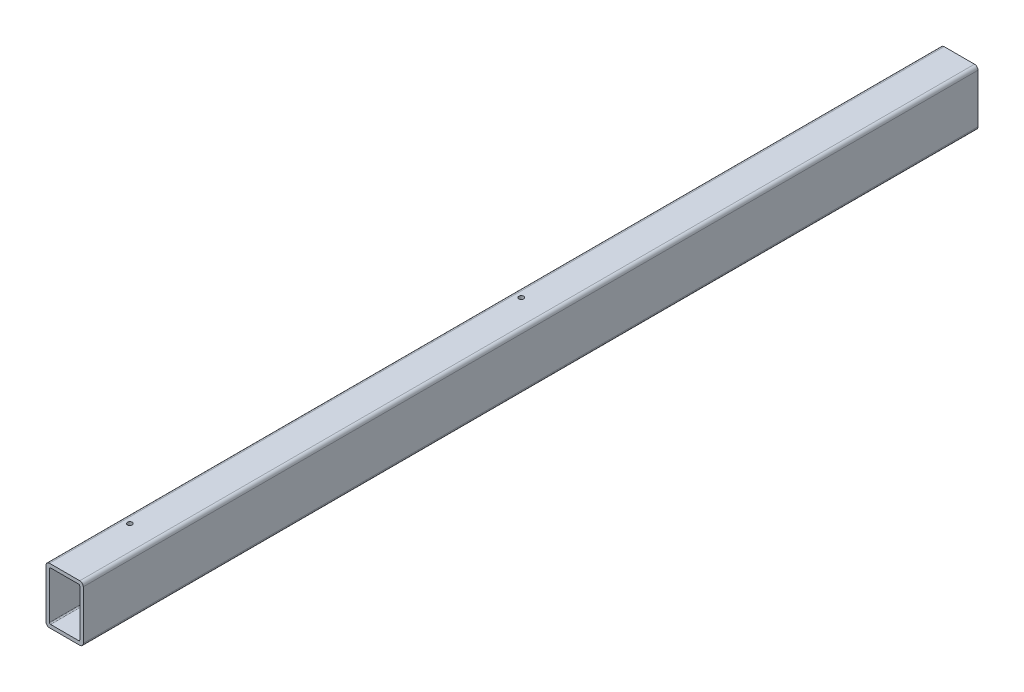
ISO-10303-21;
HEADER;
FILE_DESCRIPTION(('STEP AP214'),'2;1');
FILE_NAME('part.step','',(''),(''),'','','');
FILE_SCHEMA(('AUTOMOTIVE_DESIGN { 1 0 10303 214 1 1 1 1 }'));
ENDSEC;
DATA;
#1=APPLICATION_CONTEXT('core data for automotive mechanical design processes');
#2=APPLICATION_PROTOCOL_DEFINITION('international standard','automotive_design',2000,#1);
#3=PRODUCT_CONTEXT('',#1,'mechanical');
#4=PRODUCT('Part','Part','',(#3));
#5=PRODUCT_RELATED_PRODUCT_CATEGORY('part','',(#4));
#6=PRODUCT_DEFINITION_FORMATION('','',#4);
#7=PRODUCT_DEFINITION_CONTEXT('part definition',#1,'design');
#8=PRODUCT_DEFINITION('design','',#6,#7);
#9=PRODUCT_DEFINITION_SHAPE('','',#8);
#10=(LENGTH_UNIT() NAMED_UNIT(*) SI_UNIT(.MILLI.,.METRE.));
#11=(NAMED_UNIT(*) PLANE_ANGLE_UNIT() SI_UNIT($,.RADIAN.));
#12=(NAMED_UNIT(*) SI_UNIT($,.STERADIAN.) SOLID_ANGLE_UNIT());
#13=UNCERTAINTY_MEASURE_WITH_UNIT(LENGTH_MEASURE(1.E-05),#10,'distance_accuracy_value','');
#14=(GEOMETRIC_REPRESENTATION_CONTEXT(3) GLOBAL_UNCERTAINTY_ASSIGNED_CONTEXT((#13)) GLOBAL_UNIT_ASSIGNED_CONTEXT((#10,
#11,#12)) REPRESENTATION_CONTEXT('',''));
#15=CARTESIAN_POINT('',(0.,0.,0.));
#16=DIRECTION('',(0.,0.,1.));
#17=DIRECTION('',(1.,0.,0.));
#18=AXIS2_PLACEMENT_3D('',#15,#16,#17);
#19=CARTESIAN_POINT('',(-20.6375,-33.3375,609.6));
#20=DIRECTION('',(0.,0.,1.));
#21=DIRECTION('',(1.,0.,0.));
#22=AXIS2_PLACEMENT_3D('',#19,#20,#21);
#23=PLANE('',#22);
#24=CARTESIAN_POINT('',(-20.6375,-33.3375,609.6));
#25=DIRECTION('',(0.,0.,1.));
#26=DIRECTION('',(1.,0.,0.));
#27=AXIS2_PLACEMENT_3D('',#24,#25,#26);
#28=CIRCLE('',#27,4.7625);
#29=CARTESIAN_POINT('',(-25.4,-33.3375,609.6));
#30=VERTEX_POINT('',#29);
#31=CARTESIAN_POINT('',(-20.6375,-38.1,609.6));
#32=VERTEX_POINT('',#31);
#33=EDGE_CURVE('E212',#30,#32,#28,.T.);
#34=ORIENTED_EDGE('',*,*,#33,.T.);
#35=DIRECTION('',(1.,0.,0.));
#36=VECTOR('',#35,1.);
#37=CARTESIAN_POINT('',(-20.6375,-38.1,609.6));
#38=LINE('',#37,#36);
#39=CARTESIAN_POINT('',(20.6375,-38.1,609.6));
#40=VERTEX_POINT('',#39);
#41=EDGE_CURVE('E215',#32,#40,#38,.T.);
#42=ORIENTED_EDGE('',*,*,#41,.T.);
#43=CARTESIAN_POINT('',(20.6375,-33.3375,609.6));
#44=DIRECTION('',(0.,0.,1.));
#45=DIRECTION('',(1.,0.,0.));
#46=AXIS2_PLACEMENT_3D('',#43,#44,#45);
#47=CIRCLE('',#46,4.7625);
#48=CARTESIAN_POINT('',(25.4,-33.3375,609.6));
#49=VERTEX_POINT('',#48);
#50=EDGE_CURVE('E218',#40,#49,#47,.T.);
#51=ORIENTED_EDGE('',*,*,#50,.T.);
#52=DIRECTION('',(0.,1.,0.));
#53=VECTOR('',#52,1.);
#54=CARTESIAN_POINT('',(25.4,33.3375,609.6));
#55=LINE('',#54,#53);
#56=CARTESIAN_POINT('',(25.4,33.3375,609.6));
#57=VERTEX_POINT('',#56);
#58=EDGE_CURVE('E220',#49,#57,#55,.T.);
#59=ORIENTED_EDGE('',*,*,#58,.T.);
#60=CARTESIAN_POINT('',(20.6375,33.3375,609.6));
#61=DIRECTION('',(0.,0.,1.));
#62=DIRECTION('',(1.,0.,0.));
#63=AXIS2_PLACEMENT_3D('',#60,#61,#62);
#64=CIRCLE('',#63,4.7625);
#65=CARTESIAN_POINT('',(20.6375,38.1,609.6));
#66=VERTEX_POINT('',#65);
#67=EDGE_CURVE('E222',#57,#66,#64,.T.);
#68=ORIENTED_EDGE('',*,*,#67,.T.);
#69=DIRECTION('',(-1.,0.,0.));
#70=VECTOR('',#69,1.);
#71=CARTESIAN_POINT('',(-20.6375,38.1,609.6));
#72=LINE('',#71,#70);
#73=CARTESIAN_POINT('',(-20.6375,38.1,609.6));
#74=VERTEX_POINT('',#73);
#75=EDGE_CURVE('E224',#66,#74,#72,.T.);
#76=ORIENTED_EDGE('',*,*,#75,.T.);
#77=CARTESIAN_POINT('',(-20.6375,33.3375,609.6));
#78=DIRECTION('',(0.,0.,1.));
#79=DIRECTION('',(1.,0.,0.));
#80=AXIS2_PLACEMENT_3D('',#77,#78,#79);
#81=CIRCLE('',#80,4.7625);
#82=CARTESIAN_POINT('',(-25.4,33.3375,609.6));
#83=VERTEX_POINT('',#82);
#84=EDGE_CURVE('E226',#74,#83,#81,.T.);
#85=ORIENTED_EDGE('',*,*,#84,.T.);
#86=DIRECTION('',(0.,-1.,0.));
#87=VECTOR('',#86,1.);
#88=CARTESIAN_POINT('',(-25.4,33.3375,609.6));
#89=LINE('',#88,#87);
#90=EDGE_CURVE('E228',#83,#30,#89,.T.);
#91=ORIENTED_EDGE('',*,*,#90,.T.);
#92=EDGE_LOOP('',(#34,#42,#51,#59,#68,#76,#85,#91));
#93=FACE_BOUND('',#92,.T.);
#94=DIRECTION('',(1.,0.,0.));
#95=VECTOR('',#94,1.);
#96=CARTESIAN_POINT('',(-19.05,-33.3375,609.6));
#97=LINE('',#96,#95);
#98=CARTESIAN_POINT('',(-19.05,-33.3375,609.6));
#99=VERTEX_POINT('',#98);
#100=CARTESIAN_POINT('',(19.05,-33.3375,609.6));
#101=VERTEX_POINT('',#100);
#102=EDGE_CURVE('E153',#99,#101,#97,.T.);
#103=ORIENTED_EDGE('',*,*,#102,.F.);
#104=CARTESIAN_POINT('',(-19.05,-31.75,609.6));
#105=DIRECTION('',(0.,0.,1.));
#106=DIRECTION('',(1.,0.,0.));
#107=AXIS2_PLACEMENT_3D('',#104,#105,#106);
#108=CIRCLE('',#107,1.5875);
#109=CARTESIAN_POINT('',(-20.6375,-31.75,609.6));
#110=VERTEX_POINT('',#109);
#111=EDGE_CURVE('E145',#110,#99,#108,.T.);
#112=ORIENTED_EDGE('',*,*,#111,.F.);
#113=DIRECTION('',(0.,-1.,0.));
#114=VECTOR('',#113,1.);
#115=CARTESIAN_POINT('',(-20.6375,31.75,609.6));
#116=LINE('',#115,#114);
#117=CARTESIAN_POINT('',(-20.6375,31.75,609.6));
#118=VERTEX_POINT('',#117);
#119=EDGE_CURVE('E179',#118,#110,#116,.T.);
#120=ORIENTED_EDGE('',*,*,#119,.F.);
#121=CARTESIAN_POINT('',(-19.05,31.75,609.6));
#122=DIRECTION('',(0.,0.,1.));
#123=DIRECTION('',(1.,0.,0.));
#124=AXIS2_PLACEMENT_3D('',#121,#122,#123);
#125=CIRCLE('',#124,1.5875);
#126=CARTESIAN_POINT('',(-19.05,33.3375,609.6));
#127=VERTEX_POINT('',#126);
#128=EDGE_CURVE('E177',#127,#118,#125,.T.);
#129=ORIENTED_EDGE('',*,*,#128,.F.);
#130=DIRECTION('',(-1.,0.,0.));
#131=VECTOR('',#130,1.);
#132=CARTESIAN_POINT('',(-19.05,33.3375,609.6));
#133=LINE('',#132,#131);
#134=CARTESIAN_POINT('',(19.05,33.3375,609.6));
#135=VERTEX_POINT('',#134);
#136=EDGE_CURVE('E175',#135,#127,#133,.T.);
#137=ORIENTED_EDGE('',*,*,#136,.F.);
#138=CARTESIAN_POINT('',(19.05,31.75,609.6));
#139=DIRECTION('',(0.,0.,1.));
#140=DIRECTION('',(1.,0.,0.));
#141=AXIS2_PLACEMENT_3D('',#138,#139,#140);
#142=CIRCLE('',#141,1.5875);
#143=CARTESIAN_POINT('',(20.6375,31.75,609.6));
#144=VERTEX_POINT('',#143);
#145=EDGE_CURVE('E173',#144,#135,#142,.T.);
#146=ORIENTED_EDGE('',*,*,#145,.F.);
#147=DIRECTION('',(0.,1.,0.));
#148=VECTOR('',#147,1.);
#149=CARTESIAN_POINT('',(20.6375,31.75,609.6));
#150=LINE('',#149,#148);
#151=CARTESIAN_POINT('',(20.6375,-31.75,609.6));
#152=VERTEX_POINT('',#151);
#153=EDGE_CURVE('E168',#152,#144,#150,.T.);
#154=ORIENTED_EDGE('',*,*,#153,.F.);
#155=CARTESIAN_POINT('',(19.05,-31.75,609.6));
#156=DIRECTION('',(0.,0.,1.));
#157=DIRECTION('',(1.,0.,0.));
#158=AXIS2_PLACEMENT_3D('',#155,#156,#157);
#159=CIRCLE('',#158,1.5875);
#160=EDGE_CURVE('E166',#101,#152,#159,.T.);
#161=ORIENTED_EDGE('',*,*,#160,.F.);
#162=EDGE_LOOP('',(#103,#112,#120,#129,#137,#146,#154,#161));
#163=FACE_BOUND('',#162,.T.);
#164=ADVANCED_FACE('F32',(#93,#163),#23,.T.);
#165=CARTESIAN_POINT('',(-20.6375,-33.3375,-609.6));
#166=DIRECTION('',(0.,0.,1.));
#167=DIRECTION('',(1.,0.,0.));
#168=AXIS2_PLACEMENT_3D('',#165,#166,#167);
#169=PLANE('',#168);
#170=CARTESIAN_POINT('',(-20.6375,-33.3375,-609.6));
#171=DIRECTION('',(0.,0.,1.));
#172=DIRECTION('',(1.,0.,0.));
#173=AXIS2_PLACEMENT_3D('',#170,#171,#172);
#174=CIRCLE('',#173,4.7625);
#175=CARTESIAN_POINT('',(-25.4,-33.3375,-609.6));
#176=VERTEX_POINT('',#175);
#177=CARTESIAN_POINT('',(-20.6375,-38.1,-609.6));
#178=VERTEX_POINT('',#177);
#179=EDGE_CURVE('E161',#176,#178,#174,.T.);
#180=ORIENTED_EDGE('',*,*,#179,.F.);
#181=DIRECTION('',(0.,-1.,0.));
#182=VECTOR('',#181,1.);
#183=CARTESIAN_POINT('',(-25.4,33.3375,-609.6));
#184=LINE('',#183,#182);
#185=CARTESIAN_POINT('',(-25.4,33.3375,-609.6));
#186=VERTEX_POINT('',#185);
#187=EDGE_CURVE('E216',#186,#176,#184,.T.);
#188=ORIENTED_EDGE('',*,*,#187,.F.);
#189=CARTESIAN_POINT('',(-20.6375,33.3375,-609.6));
#190=DIRECTION('',(0.,0.,1.));
#191=DIRECTION('',(1.,0.,0.));
#192=AXIS2_PLACEMENT_3D('',#189,#190,#191);
#193=CIRCLE('',#192,4.7625);
#194=CARTESIAN_POINT('',(-20.6375,38.1,-609.6));
#195=VERTEX_POINT('',#194);
#196=EDGE_CURVE('E243',#195,#186,#193,.T.);
#197=ORIENTED_EDGE('',*,*,#196,.F.);
#198=DIRECTION('',(-1.,0.,0.));
#199=VECTOR('',#198,1.);
#200=CARTESIAN_POINT('',(-20.6375,38.1,-609.6));
#201=LINE('',#200,#199);
#202=CARTESIAN_POINT('',(20.6375,38.1,-609.6));
#203=VERTEX_POINT('',#202);
#204=EDGE_CURVE('E241',#203,#195,#201,.T.);
#205=ORIENTED_EDGE('',*,*,#204,.F.);
#206=CARTESIAN_POINT('',(20.6375,33.3375,-609.6));
#207=DIRECTION('',(0.,0.,1.));
#208=DIRECTION('',(1.,0.,0.));
#209=AXIS2_PLACEMENT_3D('',#206,#207,#208);
#210=CIRCLE('',#209,4.7625);
#211=CARTESIAN_POINT('',(25.4,33.3375,-609.6));
#212=VERTEX_POINT('',#211);
#213=EDGE_CURVE('E239',#212,#203,#210,.T.);
#214=ORIENTED_EDGE('',*,*,#213,.F.);
#215=DIRECTION('',(0.,1.,0.));
#216=VECTOR('',#215,1.);
#217=CARTESIAN_POINT('',(25.4,33.3375,-609.6));
#218=LINE('',#217,#216);
#219=CARTESIAN_POINT('',(25.4,-33.3375,-609.6));
#220=VERTEX_POINT('',#219);
#221=EDGE_CURVE('E237',#220,#212,#218,.T.);
#222=ORIENTED_EDGE('',*,*,#221,.F.);
#223=CARTESIAN_POINT('',(20.6375,-33.3375,-609.6));
#224=DIRECTION('',(0.,0.,1.));
#225=DIRECTION('',(1.,0.,0.));
#226=AXIS2_PLACEMENT_3D('',#223,#224,#225);
#227=CIRCLE('',#226,4.7625);
#228=CARTESIAN_POINT('',(20.6375,-38.1,-609.6));
#229=VERTEX_POINT('',#228);
#230=EDGE_CURVE('E235',#229,#220,#227,.T.);
#231=ORIENTED_EDGE('',*,*,#230,.F.);
#232=DIRECTION('',(1.,0.,0.));
#233=VECTOR('',#232,1.);
#234=CARTESIAN_POINT('',(-20.6375,-38.1,-609.6));
#235=LINE('',#234,#233);
#236=EDGE_CURVE('E233',#178,#229,#235,.T.);
#237=ORIENTED_EDGE('',*,*,#236,.F.);
#238=EDGE_LOOP('',(#180,#188,#197,#205,#214,#222,#231,#237));
#239=FACE_BOUND('',#238,.T.);
#240=CARTESIAN_POINT('',(-19.05,-31.75,-609.6));
#241=DIRECTION('',(0.,0.,1.));
#242=DIRECTION('',(1.,0.,0.));
#243=AXIS2_PLACEMENT_3D('',#240,#241,#242);
#244=CIRCLE('',#243,1.5875);
#245=CARTESIAN_POINT('',(-20.6375,-31.75,-609.6));
#246=VERTEX_POINT('',#245);
#247=CARTESIAN_POINT('',(-19.05,-33.3375,-609.6));
#248=VERTEX_POINT('',#247);
#249=EDGE_CURVE('E55',#246,#248,#244,.T.);
#250=ORIENTED_EDGE('',*,*,#249,.T.);
#251=DIRECTION('',(1.,0.,0.));
#252=VECTOR('',#251,1.);
#253=CARTESIAN_POINT('',(-19.05,-33.3375,-609.6));
#254=LINE('',#253,#252);
#255=CARTESIAN_POINT('',(19.05,-33.3375,-609.6));
#256=VERTEX_POINT('',#255);
#257=EDGE_CURVE('E160',#248,#256,#254,.T.);
#258=ORIENTED_EDGE('',*,*,#257,.T.);
#259=CARTESIAN_POINT('',(19.05,-31.75,-609.6));
#260=DIRECTION('',(0.,0.,1.));
#261=DIRECTION('',(1.,0.,0.));
#262=AXIS2_PLACEMENT_3D('',#259,#260,#261);
#263=CIRCLE('',#262,1.5875);
#264=CARTESIAN_POINT('',(20.6375,-31.75,-609.6));
#265=VERTEX_POINT('',#264);
#266=EDGE_CURVE('E184',#256,#265,#263,.T.);
#267=ORIENTED_EDGE('',*,*,#266,.T.);
#268=DIRECTION('',(0.,1.,0.));
#269=VECTOR('',#268,1.);
#270=CARTESIAN_POINT('',(20.6375,31.75,-609.6));
#271=LINE('',#270,#269);
#272=CARTESIAN_POINT('',(20.6375,31.75,-609.6));
#273=VERTEX_POINT('',#272);
#274=EDGE_CURVE('E187',#265,#273,#271,.T.);
#275=ORIENTED_EDGE('',*,*,#274,.T.);
#276=CARTESIAN_POINT('',(19.05,31.75,-609.6));
#277=DIRECTION('',(0.,0.,1.));
#278=DIRECTION('',(1.,0.,0.));
#279=AXIS2_PLACEMENT_3D('',#276,#277,#278);
#280=CIRCLE('',#279,1.5875);
#281=CARTESIAN_POINT('',(19.05,33.3375,-609.6));
#282=VERTEX_POINT('',#281);
#283=EDGE_CURVE('E190',#273,#282,#280,.T.);
#284=ORIENTED_EDGE('',*,*,#283,.T.);
#285=DIRECTION('',(-1.,0.,0.));
#286=VECTOR('',#285,1.);
#287=CARTESIAN_POINT('',(-19.05,33.3375,-609.6));
#288=LINE('',#287,#286);
#289=CARTESIAN_POINT('',(-19.05,33.3375,-609.6));
#290=VERTEX_POINT('',#289);
#291=EDGE_CURVE('E193',#282,#290,#288,.T.);
#292=ORIENTED_EDGE('',*,*,#291,.T.);
#293=CARTESIAN_POINT('',(-19.05,31.75,-609.6));
#294=DIRECTION('',(0.,0.,1.));
#295=DIRECTION('',(1.,0.,0.));
#296=AXIS2_PLACEMENT_3D('',#293,#294,#295);
#297=CIRCLE('',#296,1.5875);
#298=CARTESIAN_POINT('',(-20.6375,31.75,-609.6));
#299=VERTEX_POINT('',#298);
#300=EDGE_CURVE('E196',#290,#299,#297,.T.);
#301=ORIENTED_EDGE('',*,*,#300,.T.);
#302=DIRECTION('',(0.,-1.,0.));
#303=VECTOR('',#302,1.);
#304=CARTESIAN_POINT('',(-20.6375,31.75,-609.6));
#305=LINE('',#304,#303);
#306=EDGE_CURVE('E154',#299,#246,#305,.T.);
#307=ORIENTED_EDGE('',*,*,#306,.T.);
#308=EDGE_LOOP('',(#250,#258,#267,#275,#284,#292,#301,#307));
#309=FACE_BOUND('',#308,.T.);
#310=ADVANCED_FACE('F273',(#239,#309),#169,.F.);
#311=CARTESIAN_POINT('',(-20.6375,-33.3375,609.6));
#312=DIRECTION('',(0.,0.,-1.));
#313=DIRECTION('',(-1.,0.,0.));
#314=AXIS2_PLACEMENT_3D('',#311,#312,#313);
#315=CYLINDRICAL_SURFACE('',#314,4.7625);
#316=ORIENTED_EDGE('',*,*,#179,.T.);
#317=DIRECTION('',(0.,0.,-1.));
#318=VECTOR('',#317,1.);
#319=CARTESIAN_POINT('',(-20.6375,-38.1,609.6));
#320=LINE('',#319,#318);
#321=EDGE_CURVE('E11',#32,#178,#320,.T.);
#322=ORIENTED_EDGE('',*,*,#321,.F.);
#323=ORIENTED_EDGE('',*,*,#33,.F.);
#324=DIRECTION('',(0.,0.,-1.));
#325=VECTOR('',#324,1.);
#326=CARTESIAN_POINT('',(-25.4,-33.3375,609.6));
#327=LINE('',#326,#325);
#328=EDGE_CURVE('E230',#30,#176,#327,.T.);
#329=ORIENTED_EDGE('',*,*,#328,.T.);
#330=EDGE_LOOP('',(#316,#322,#323,#329));
#331=FACE_BOUND('',#330,.T.);
#332=ADVANCED_FACE('F34',(#331),#315,.T.);
#333=CARTESIAN_POINT('',(-20.6375,-38.1,609.6));
#334=DIRECTION('',(0.,1.,0.));
#335=DIRECTION('',(0.,0.,1.));
#336=AXIS2_PLACEMENT_3D('',#333,#334,#335);
#337=PLANE('',#336);
#338=ORIENTED_EDGE('',*,*,#236,.T.);
#339=DIRECTION('',(0.,0.,-1.));
#340=VECTOR('',#339,1.);
#341=CARTESIAN_POINT('',(20.6375,-38.1,609.6));
#342=LINE('',#341,#340);
#343=EDGE_CURVE('E40',#40,#229,#342,.T.);
#344=ORIENTED_EDGE('',*,*,#343,.F.);
#345=ORIENTED_EDGE('',*,*,#41,.F.);
#346=ORIENTED_EDGE('',*,*,#321,.T.);
#347=EDGE_LOOP('',(#338,#344,#345,#346));
#348=FACE_BOUND('',#347,.T.);
#349=ADVANCED_FACE('F290',(#348),#337,.F.);
#350=CARTESIAN_POINT('',(20.6375,-33.3375,609.6));
#351=DIRECTION('',(0.,0.,-1.));
#352=DIRECTION('',(-1.,0.,0.));
#353=AXIS2_PLACEMENT_3D('',#350,#351,#352);
#354=CYLINDRICAL_SURFACE('',#353,4.7625);
#355=ORIENTED_EDGE('',*,*,#230,.T.);
#356=DIRECTION('',(0.,0.,-1.));
#357=VECTOR('',#356,1.);
#358=CARTESIAN_POINT('',(25.4,-33.3375,609.6));
#359=LINE('',#358,#357);
#360=EDGE_CURVE('E260',#49,#220,#359,.T.);
#361=ORIENTED_EDGE('',*,*,#360,.F.);
#362=ORIENTED_EDGE('',*,*,#50,.F.);
#363=ORIENTED_EDGE('',*,*,#343,.T.);
#364=EDGE_LOOP('',(#355,#361,#362,#363));
#365=FACE_BOUND('',#364,.T.);
#366=ADVANCED_FACE('F267',(#365),#354,.T.);
#367=CARTESIAN_POINT('',(25.4,33.3375,609.6));
#368=DIRECTION('',(-1.,0.,0.));
#369=DIRECTION('',(0.,-1.,0.));
#370=AXIS2_PLACEMENT_3D('',#367,#368,#369);
#371=PLANE('',#370);
#372=ORIENTED_EDGE('',*,*,#221,.T.);
#373=DIRECTION('',(0.,0.,-1.));
#374=VECTOR('',#373,1.);
#375=CARTESIAN_POINT('',(25.4,33.3375,609.6));
#376=LINE('',#375,#374);
#377=EDGE_CURVE('E257',#57,#212,#376,.T.);
#378=ORIENTED_EDGE('',*,*,#377,.F.);
#379=ORIENTED_EDGE('',*,*,#58,.F.);
#380=ORIENTED_EDGE('',*,*,#360,.T.);
#381=EDGE_LOOP('',(#372,#378,#379,#380));
#382=FACE_BOUND('',#381,.T.);
#383=ADVANCED_FACE('F279',(#382),#371,.F.);
#384=CARTESIAN_POINT('',(20.6375,33.3375,609.6));
#385=DIRECTION('',(0.,0.,-1.));
#386=DIRECTION('',(-1.,0.,0.));
#387=AXIS2_PLACEMENT_3D('',#384,#385,#386);
#388=CYLINDRICAL_SURFACE('',#387,4.7625);
#389=ORIENTED_EDGE('',*,*,#213,.T.);
#390=DIRECTION('',(0.,0.,-1.));
#391=VECTOR('',#390,1.);
#392=CARTESIAN_POINT('',(20.6375,38.1,609.6));
#393=LINE('',#392,#391);
#394=EDGE_CURVE('E254',#66,#203,#393,.T.);
#395=ORIENTED_EDGE('',*,*,#394,.F.);
#396=ORIENTED_EDGE('',*,*,#67,.F.);
#397=ORIENTED_EDGE('',*,*,#377,.T.);
#398=EDGE_LOOP('',(#389,#395,#396,#397));
#399=FACE_BOUND('',#398,.T.);
#400=ADVANCED_FACE('F283',(#399),#388,.T.);
#401=CARTESIAN_POINT('',(-20.6375,38.1,609.6));
#402=DIRECTION('',(0.,-1.,0.));
#403=DIRECTION('',(0.,0.,-1.));
#404=AXIS2_PLACEMENT_3D('',#401,#402,#403);
#405=PLANE('',#404);
#406=CARTESIAN_POINT('',(-12.6999999999999,38.1,508.));
#407=DIRECTION('',(0.,1.,0.));
#408=DIRECTION('',(0.,0.,1.));
#409=AXIS2_PLACEMENT_3D('',#406,#407,#408);
#410=CIRCLE('',#409,3.26389999999999);
#411=CARTESIAN_POINT('',(-12.6999999999999,38.1,511.2639));
#412=VERTEX_POINT('',#411);
#413=EDGE_CURVE('E368',#412,#412,#410,.T.);
#414=ORIENTED_EDGE('',*,*,#413,.F.);
#415=EDGE_LOOP('',(#414));
#416=FACE_BOUND('',#415,.T.);
#417=CARTESIAN_POINT('',(-12.7,38.1,-25.4));
#418=DIRECTION('',(0.,1.,0.));
#419=DIRECTION('',(0.,0.,1.));
#420=AXIS2_PLACEMENT_3D('',#417,#418,#419);
#421=CIRCLE('',#420,3.26389999999999);
#422=CARTESIAN_POINT('',(-12.7,38.1,-22.1361));
#423=VERTEX_POINT('',#422);
#424=EDGE_CURVE('E372',#423,#423,#421,.T.);
#425=ORIENTED_EDGE('',*,*,#424,.F.);
#426=EDGE_LOOP('',(#425));
#427=FACE_BOUND('',#426,.T.);
#428=ORIENTED_EDGE('',*,*,#204,.T.);
#429=DIRECTION('',(0.,0.,-1.));
#430=VECTOR('',#429,1.);
#431=CARTESIAN_POINT('',(-20.6375,38.1,609.6));
#432=LINE('',#431,#430);
#433=EDGE_CURVE('E251',#74,#195,#432,.T.);
#434=ORIENTED_EDGE('',*,*,#433,.F.);
#435=ORIENTED_EDGE('',*,*,#75,.F.);
#436=ORIENTED_EDGE('',*,*,#394,.T.);
#437=EDGE_LOOP('',(#428,#434,#435,#436));
#438=FACE_BOUND('',#437,.T.);
#439=ADVANCED_FACE('F303',(#416,#427,#438),#405,.F.);
#440=CARTESIAN_POINT('',(-20.6375,33.3375,609.6));
#441=DIRECTION('',(0.,0.,-1.));
#442=DIRECTION('',(-1.,0.,0.));
#443=AXIS2_PLACEMENT_3D('',#440,#441,#442);
#444=CYLINDRICAL_SURFACE('',#443,4.7625);
#445=ORIENTED_EDGE('',*,*,#196,.T.);
#446=DIRECTION('',(0.,0.,-1.));
#447=VECTOR('',#446,1.);
#448=CARTESIAN_POINT('',(-25.4,33.3375,609.6));
#449=LINE('',#448,#447);
#450=EDGE_CURVE('E248',#83,#186,#449,.T.);
#451=ORIENTED_EDGE('',*,*,#450,.F.);
#452=ORIENTED_EDGE('',*,*,#84,.F.);
#453=ORIENTED_EDGE('',*,*,#433,.T.);
#454=EDGE_LOOP('',(#445,#451,#452,#453));
#455=FACE_BOUND('',#454,.T.);
#456=ADVANCED_FACE('F301',(#455),#444,.T.);
#457=CARTESIAN_POINT('',(-25.4,33.3375,609.6));
#458=DIRECTION('',(1.,0.,0.));
#459=DIRECTION('',(0.,0.,-1.));
#460=AXIS2_PLACEMENT_3D('',#457,#458,#459);
#461=PLANE('',#460);
#462=ORIENTED_EDGE('',*,*,#187,.T.);
#463=ORIENTED_EDGE('',*,*,#328,.F.);
#464=ORIENTED_EDGE('',*,*,#90,.F.);
#465=ORIENTED_EDGE('',*,*,#450,.T.);
#466=EDGE_LOOP('',(#462,#463,#464,#465));
#467=FACE_BOUND('',#466,.T.);
#468=ADVANCED_FACE('F296',(#467),#461,.F.);
#469=CARTESIAN_POINT('',(-19.05,-31.75,609.6));
#470=DIRECTION('',(0.,0.,-1.));
#471=DIRECTION('',(-1.,0.,0.));
#472=AXIS2_PLACEMENT_3D('',#469,#470,#471);
#473=CYLINDRICAL_SURFACE('',#472,1.5875);
#474=ORIENTED_EDGE('',*,*,#249,.F.);
#475=DIRECTION('',(0.,0.,-1.));
#476=VECTOR('',#475,1.);
#477=CARTESIAN_POINT('',(-20.6375,-31.75,609.6));
#478=LINE('',#477,#476);
#479=EDGE_CURVE('E149',#110,#246,#478,.T.);
#480=ORIENTED_EDGE('',*,*,#479,.F.);
#481=ORIENTED_EDGE('',*,*,#111,.T.);
#482=DIRECTION('',(0.,0.,-1.));
#483=VECTOR('',#482,1.);
#484=CARTESIAN_POINT('',(-19.05,-33.3375,609.6));
#485=LINE('',#484,#483);
#486=EDGE_CURVE('E148',#99,#248,#485,.T.);
#487=ORIENTED_EDGE('',*,*,#486,.T.);
#488=EDGE_LOOP('',(#474,#480,#481,#487));
#489=FACE_BOUND('',#488,.T.);
#490=ADVANCED_FACE('F147',(#489),#473,.F.);
#491=CARTESIAN_POINT('',(-19.05,-33.3375,609.6));
#492=DIRECTION('',(0.,1.,0.));
#493=DIRECTION('',(0.,0.,1.));
#494=AXIS2_PLACEMENT_3D('',#491,#492,#493);
#495=PLANE('',#494);
#496=ORIENTED_EDGE('',*,*,#257,.F.);
#497=ORIENTED_EDGE('',*,*,#486,.F.);
#498=ORIENTED_EDGE('',*,*,#102,.T.);
#499=DIRECTION('',(0.,0.,-1.));
#500=VECTOR('',#499,1.);
#501=CARTESIAN_POINT('',(19.05,-33.3375,609.6));
#502=LINE('',#501,#500);
#503=EDGE_CURVE('E162',#101,#256,#502,.T.);
#504=ORIENTED_EDGE('',*,*,#503,.T.);
#505=EDGE_LOOP('',(#496,#497,#498,#504));
#506=FACE_BOUND('',#505,.T.);
#507=ADVANCED_FACE('F157',(#506),#495,.T.);
#508=CARTESIAN_POINT('',(19.05,-31.75,609.6));
#509=DIRECTION('',(0.,0.,-1.));
#510=DIRECTION('',(-1.,0.,0.));
#511=AXIS2_PLACEMENT_3D('',#508,#509,#510);
#512=CYLINDRICAL_SURFACE('',#511,1.5875);
#513=ORIENTED_EDGE('',*,*,#266,.F.);
#514=ORIENTED_EDGE('',*,*,#503,.F.);
#515=ORIENTED_EDGE('',*,*,#160,.T.);
#516=DIRECTION('',(0.,0.,-1.));
#517=VECTOR('',#516,1.);
#518=CARTESIAN_POINT('',(20.6375,-31.75,609.6));
#519=LINE('',#518,#517);
#520=EDGE_CURVE('E209',#152,#265,#519,.T.);
#521=ORIENTED_EDGE('',*,*,#520,.T.);
#522=EDGE_LOOP('',(#513,#514,#515,#521));
#523=FACE_BOUND('',#522,.T.);
#524=ADVANCED_FACE('F331',(#523),#512,.F.);
#525=CARTESIAN_POINT('',(20.6375,31.75,609.6));
#526=DIRECTION('',(-1.,0.,0.));
#527=DIRECTION('',(0.,-1.,0.));
#528=AXIS2_PLACEMENT_3D('',#525,#526,#527);
#529=PLANE('',#528);
#530=ORIENTED_EDGE('',*,*,#274,.F.);
#531=ORIENTED_EDGE('',*,*,#520,.F.);
#532=ORIENTED_EDGE('',*,*,#153,.T.);
#533=DIRECTION('',(0.,0.,-1.));
#534=VECTOR('',#533,1.);
#535=CARTESIAN_POINT('',(20.6375,31.75,609.6));
#536=LINE('',#535,#534);
#537=EDGE_CURVE('E207',#144,#273,#536,.T.);
#538=ORIENTED_EDGE('',*,*,#537,.T.);
#539=EDGE_LOOP('',(#530,#531,#532,#538));
#540=FACE_BOUND('',#539,.T.);
#541=ADVANCED_FACE('F335',(#540),#529,.T.);
#542=CARTESIAN_POINT('',(19.05,31.75,609.6));
#543=DIRECTION('',(0.,0.,-1.));
#544=DIRECTION('',(-1.,0.,0.));
#545=AXIS2_PLACEMENT_3D('',#542,#543,#544);
#546=CYLINDRICAL_SURFACE('',#545,1.5875);
#547=ORIENTED_EDGE('',*,*,#283,.F.);
#548=ORIENTED_EDGE('',*,*,#537,.F.);
#549=ORIENTED_EDGE('',*,*,#145,.T.);
#550=DIRECTION('',(0.,0.,-1.));
#551=VECTOR('',#550,1.);
#552=CARTESIAN_POINT('',(19.05,33.3375,609.6));
#553=LINE('',#552,#551);
#554=EDGE_CURVE('E205',#135,#282,#553,.T.);
#555=ORIENTED_EDGE('',*,*,#554,.T.);
#556=EDGE_LOOP('',(#547,#548,#549,#555));
#557=FACE_BOUND('',#556,.T.);
#558=ADVANCED_FACE('F341',(#557),#546,.F.);
#559=CARTESIAN_POINT('',(-19.05,33.3375,609.6));
#560=DIRECTION('',(0.,-1.,0.));
#561=DIRECTION('',(0.,0.,-1.));
#562=AXIS2_PLACEMENT_3D('',#559,#560,#561);
#563=PLANE('',#562);
#564=CARTESIAN_POINT('',(-12.6999999999999,33.3375,508.));
#565=DIRECTION('',(0.,-1.,0.));
#566=DIRECTION('',(0.,0.,-1.));
#567=AXIS2_PLACEMENT_3D('',#564,#565,#566);
#568=CIRCLE('',#567,3.26389999999999);
#569=CARTESIAN_POINT('',(-12.6999999999999,33.3375,504.7361));
#570=VERTEX_POINT('',#569);
#571=EDGE_CURVE('E371',#570,#570,#568,.T.);
#572=ORIENTED_EDGE('',*,*,#571,.F.);
#573=EDGE_LOOP('',(#572));
#574=FACE_BOUND('',#573,.T.);
#575=CARTESIAN_POINT('',(-12.7,33.3375,-25.4));
#576=DIRECTION('',(0.,-1.,0.));
#577=DIRECTION('',(0.,0.,-1.));
#578=AXIS2_PLACEMENT_3D('',#575,#576,#577);
#579=CIRCLE('',#578,3.26389999999999);
#580=CARTESIAN_POINT('',(-12.7,33.3375,-28.6639));
#581=VERTEX_POINT('',#580);
#582=EDGE_CURVE('E182',#581,#581,#579,.T.);
#583=ORIENTED_EDGE('',*,*,#582,.F.);
#584=EDGE_LOOP('',(#583));
#585=FACE_BOUND('',#584,.T.);
#586=ORIENTED_EDGE('',*,*,#291,.F.);
#587=ORIENTED_EDGE('',*,*,#554,.F.);
#588=ORIENTED_EDGE('',*,*,#136,.T.);
#589=DIRECTION('',(0.,0.,-1.));
#590=VECTOR('',#589,1.);
#591=CARTESIAN_POINT('',(-19.05,33.3375,609.6));
#592=LINE('',#591,#590);
#593=EDGE_CURVE('E203',#127,#290,#592,.T.);
#594=ORIENTED_EDGE('',*,*,#593,.T.);
#595=EDGE_LOOP('',(#586,#587,#588,#594));
#596=FACE_BOUND('',#595,.T.);
#597=ADVANCED_FACE('F345',(#574,#585,#596),#563,.T.);
#598=CARTESIAN_POINT('',(-19.05,31.75,609.6));
#599=DIRECTION('',(0.,0.,-1.));
#600=DIRECTION('',(-1.,0.,0.));
#601=AXIS2_PLACEMENT_3D('',#598,#599,#600);
#602=CYLINDRICAL_SURFACE('',#601,1.5875);
#603=ORIENTED_EDGE('',*,*,#300,.F.);
#604=ORIENTED_EDGE('',*,*,#593,.F.);
#605=ORIENTED_EDGE('',*,*,#128,.T.);
#606=DIRECTION('',(0.,0.,-1.));
#607=VECTOR('',#606,1.);
#608=CARTESIAN_POINT('',(-20.6375,31.75,609.6));
#609=LINE('',#608,#607);
#610=EDGE_CURVE('E47',#118,#299,#609,.T.);
#611=ORIENTED_EDGE('',*,*,#610,.T.);
#612=EDGE_LOOP('',(#603,#604,#605,#611));
#613=FACE_BOUND('',#612,.T.);
#614=ADVANCED_FACE('F349',(#613),#602,.F.);
#615=CARTESIAN_POINT('',(-20.6375,31.75,609.6));
#616=DIRECTION('',(1.,0.,0.));
#617=DIRECTION('',(0.,0.,-1.));
#618=AXIS2_PLACEMENT_3D('',#615,#616,#617);
#619=PLANE('',#618);
#620=ORIENTED_EDGE('',*,*,#306,.F.);
#621=ORIENTED_EDGE('',*,*,#610,.F.);
#622=ORIENTED_EDGE('',*,*,#119,.T.);
#623=ORIENTED_EDGE('',*,*,#479,.T.);
#624=EDGE_LOOP('',(#620,#621,#622,#623));
#625=FACE_BOUND('',#624,.T.);
#626=ADVANCED_FACE('F353',(#625),#619,.T.);
#627=CARTESIAN_POINT('',(-12.7,38.1,-25.4));
#628=DIRECTION('',(0.,1.,0.));
#629=DIRECTION('',(0.,0.,1.));
#630=AXIS2_PLACEMENT_3D('',#627,#628,#629);
#631=CYLINDRICAL_SURFACE('',#630,3.26389999999999);
#632=ORIENTED_EDGE('',*,*,#424,.T.);
#633=EDGE_LOOP('',(#632));
#634=FACE_BOUND('',#633,.T.);
#635=ORIENTED_EDGE('',*,*,#582,.T.);
#636=EDGE_LOOP('',(#635));
#637=FACE_BOUND('',#636,.T.);
#638=ADVANCED_FACE('F357',(#634,#637),#631,.F.);
#639=CARTESIAN_POINT('',(-12.6999999999999,38.1,508.));
#640=DIRECTION('',(0.,1.,0.));
#641=DIRECTION('',(0.,0.,1.));
#642=AXIS2_PLACEMENT_3D('',#639,#640,#641);
#643=CYLINDRICAL_SURFACE('',#642,3.26389999999999);
#644=ORIENTED_EDGE('',*,*,#413,.T.);
#645=EDGE_LOOP('',(#644));
#646=FACE_BOUND('',#645,.T.);
#647=ORIENTED_EDGE('',*,*,#571,.T.);
#648=EDGE_LOOP('',(#647));
#649=FACE_BOUND('',#648,.T.);
#650=ADVANCED_FACE('F360',(#646,#649),#643,.F.);
#651=CLOSED_SHELL('',(#164,#310,#332,#349,#366,#383,#400,#439,#456,#468,#490,#507,#524,#541,
#558,#597,#614,#626,#638,#650));
#652=MANIFOLD_SOLID_BREP('B2',#651);
#653=ADVANCED_BREP_SHAPE_REPRESENTATION('',(#18,#652),#14);
#654=SHAPE_DEFINITION_REPRESENTATION(#9,#653);
ENDSEC;
END-ISO-10303-21;
